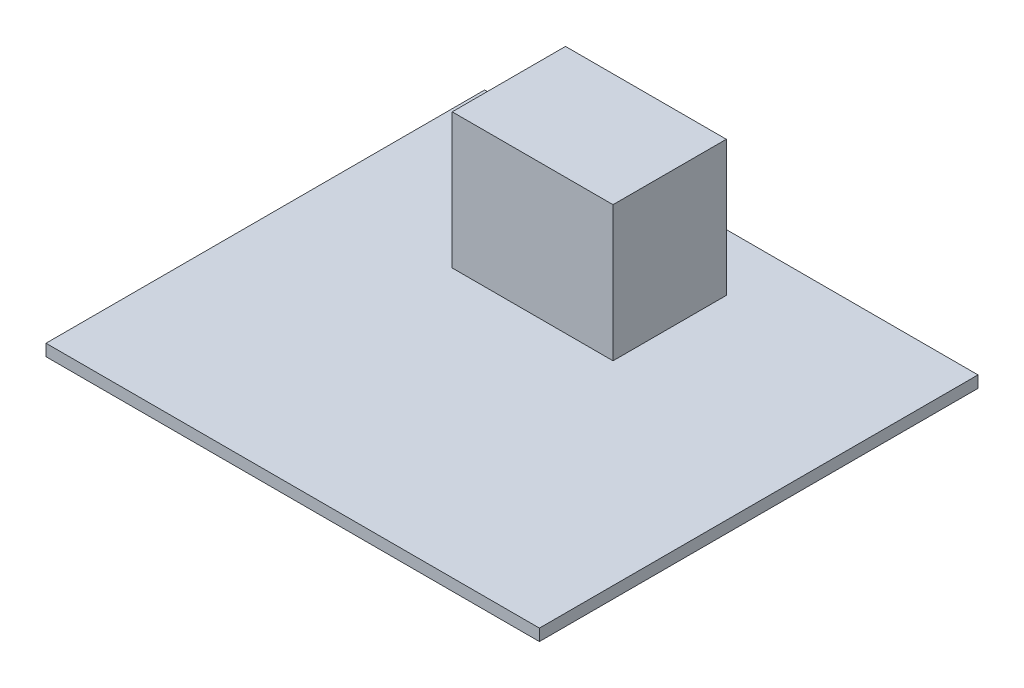
ISO-10303-21;
HEADER;
FILE_DESCRIPTION(('STEP AP214'),'2;1');
FILE_NAME('part.step','',(''),(''),'','','');
FILE_SCHEMA(('AUTOMOTIVE_DESIGN { 1 0 10303 214 1 1 1 1 }'));
ENDSEC;
DATA;
#1=APPLICATION_CONTEXT('core data for automotive mechanical design processes');
#2=APPLICATION_PROTOCOL_DEFINITION('international standard','automotive_design',2000,#1);
#3=PRODUCT_CONTEXT('',#1,'mechanical');
#4=PRODUCT('Part','Part','',(#3));
#5=PRODUCT_RELATED_PRODUCT_CATEGORY('part','',(#4));
#6=PRODUCT_DEFINITION_FORMATION('','',#4);
#7=PRODUCT_DEFINITION_CONTEXT('part definition',#1,'design');
#8=PRODUCT_DEFINITION('design','',#6,#7);
#9=PRODUCT_DEFINITION_SHAPE('','',#8);
#10=(LENGTH_UNIT() NAMED_UNIT(*) SI_UNIT(.MILLI.,.METRE.));
#11=(NAMED_UNIT(*) PLANE_ANGLE_UNIT() SI_UNIT($,.RADIAN.));
#12=(NAMED_UNIT(*) SI_UNIT($,.STERADIAN.) SOLID_ANGLE_UNIT());
#13=UNCERTAINTY_MEASURE_WITH_UNIT(LENGTH_MEASURE(1.E-05),#10,'distance_accuracy_value','');
#14=(GEOMETRIC_REPRESENTATION_CONTEXT(3) GLOBAL_UNCERTAINTY_ASSIGNED_CONTEXT((#13)) GLOBAL_UNIT_ASSIGNED_CONTEXT((#10,
#11,#12)) REPRESENTATION_CONTEXT('',''));
#15=CARTESIAN_POINT('',(0.,0.,0.));
#16=DIRECTION('',(0.,0.,1.));
#17=DIRECTION('',(1.,0.,0.));
#18=AXIS2_PLACEMENT_3D('',#15,#16,#17);
#19=CARTESIAN_POINT('',(0.,1.6,0.));
#20=DIRECTION('',(0.,1.,0.));
#21=DIRECTION('',(0.,0.,1.));
#22=AXIS2_PLACEMENT_3D('',#19,#20,#21);
#23=PLANE('',#22);
#24=DIRECTION('',(0.,0.,-1.));
#25=VECTOR('',#24,1.);
#26=CARTESIAN_POINT('',(33.75,1.6,-30.));
#27=LINE('',#26,#25);
#28=CARTESIAN_POINT('',(33.75,1.6,30.));
#29=VERTEX_POINT('',#28);
#30=CARTESIAN_POINT('',(33.75,1.6,-30.));
#31=VERTEX_POINT('',#30);
#32=EDGE_CURVE('E140',#29,#31,#27,.T.);
#33=ORIENTED_EDGE('',*,*,#32,.T.);
#34=DIRECTION('',(-1.,0.,0.));
#35=VECTOR('',#34,1.);
#36=CARTESIAN_POINT('',(-33.75,1.6,-30.));
#37=LINE('',#36,#35);
#38=CARTESIAN_POINT('',(-33.75,1.6,-30.));
#39=VERTEX_POINT('',#38);
#40=EDGE_CURVE('E85',#31,#39,#37,.T.);
#41=ORIENTED_EDGE('',*,*,#40,.T.);
#42=DIRECTION('',(0.,0.,1.));
#43=VECTOR('',#42,1.);
#44=CARTESIAN_POINT('',(-33.75,1.6,-30.));
#45=LINE('',#44,#43);
#46=CARTESIAN_POINT('',(-33.75,1.6,30.));
#47=VERTEX_POINT('',#46);
#48=EDGE_CURVE('E143',#39,#47,#45,.T.);
#49=ORIENTED_EDGE('',*,*,#48,.T.);
#50=DIRECTION('',(1.,0.,0.));
#51=VECTOR('',#50,1.);
#52=CARTESIAN_POINT('',(-33.75,1.6,30.));
#53=LINE('',#52,#51);
#54=EDGE_CURVE('E57',#47,#29,#53,.T.);
#55=ORIENTED_EDGE('',*,*,#54,.T.);
#56=EDGE_LOOP('',(#33,#41,#49,#55));
#57=FACE_BOUND('',#56,.T.);
#58=DIRECTION('',(-1.,0.,0.));
#59=VECTOR('',#58,1.);
#60=CARTESIAN_POINT('',(-14.88,1.6,-22.2));
#61=LINE('',#60,#59);
#62=CARTESIAN_POINT('',(7.12000000000001,1.6,-22.2));
#63=VERTEX_POINT('',#62);
#64=CARTESIAN_POINT('',(-14.88,1.6,-22.2));
#65=VERTEX_POINT('',#64);
#66=EDGE_CURVE('E263',#63,#65,#61,.T.);
#67=ORIENTED_EDGE('',*,*,#66,.F.);
#68=DIRECTION('',(0.,0.,-1.));
#69=VECTOR('',#68,1.);
#70=CARTESIAN_POINT('',(7.12000000000001,1.6,-22.2));
#71=LINE('',#70,#69);
#72=CARTESIAN_POINT('',(7.12000000000001,1.6,-6.69999999999999));
#73=VERTEX_POINT('',#72);
#74=EDGE_CURVE('E130',#73,#63,#71,.T.);
#75=ORIENTED_EDGE('',*,*,#74,.F.);
#76=DIRECTION('',(1.,0.,0.));
#77=VECTOR('',#76,1.);
#78=CARTESIAN_POINT('',(-14.88,1.6,-6.69999999999999));
#79=LINE('',#78,#77);
#80=CARTESIAN_POINT('',(-14.88,1.6,-6.69999999999999));
#81=VERTEX_POINT('',#80);
#82=EDGE_CURVE('E126',#81,#73,#79,.T.);
#83=ORIENTED_EDGE('',*,*,#82,.F.);
#84=DIRECTION('',(0.,0.,1.));
#85=VECTOR('',#84,1.);
#86=CARTESIAN_POINT('',(-14.88,1.6,-22.2));
#87=LINE('',#86,#85);
#88=EDGE_CURVE('E260',#65,#81,#87,.T.);
#89=ORIENTED_EDGE('',*,*,#88,.F.);
#90=EDGE_LOOP('',(#67,#75,#83,#89));
#91=FACE_BOUND('',#90,.T.);
#92=ADVANCED_FACE('F33',(#57,#91),#23,.T.);
#93=CARTESIAN_POINT('',(33.75,1.6,-30.));
#94=DIRECTION('',(-1.,0.,0.));
#95=DIRECTION('',(0.,0.,1.));
#96=AXIS2_PLACEMENT_3D('',#93,#94,#95);
#97=PLANE('',#96);
#98=DIRECTION('',(0.,0.,-1.));
#99=VECTOR('',#98,1.);
#100=CARTESIAN_POINT('',(33.75,0.,-30.));
#101=LINE('',#100,#99);
#102=CARTESIAN_POINT('',(33.75,0.,30.));
#103=VERTEX_POINT('',#102);
#104=CARTESIAN_POINT('',(33.75,0.,-30.));
#105=VERTEX_POINT('',#104);
#106=EDGE_CURVE('E132',#103,#105,#101,.T.);
#107=ORIENTED_EDGE('',*,*,#106,.T.);
#108=DIRECTION('',(0.,-1.,0.));
#109=VECTOR('',#108,1.);
#110=CARTESIAN_POINT('',(33.75,1.6,-30.));
#111=LINE('',#110,#109);
#112=EDGE_CURVE('E11',#31,#105,#111,.T.);
#113=ORIENTED_EDGE('',*,*,#112,.F.);
#114=ORIENTED_EDGE('',*,*,#32,.F.);
#115=DIRECTION('',(0.,-1.,0.));
#116=VECTOR('',#115,1.);
#117=CARTESIAN_POINT('',(33.75,1.6,30.));
#118=LINE('',#117,#116);
#119=EDGE_CURVE('E145',#29,#103,#118,.T.);
#120=ORIENTED_EDGE('',*,*,#119,.T.);
#121=EDGE_LOOP('',(#107,#113,#114,#120));
#122=FACE_BOUND('',#121,.T.);
#123=ADVANCED_FACE('F35',(#122),#97,.F.);
#124=CARTESIAN_POINT('',(-33.75,1.6,-30.));
#125=DIRECTION('',(0.,0.,1.));
#126=DIRECTION('',(1.,0.,0.));
#127=AXIS2_PLACEMENT_3D('',#124,#125,#126);
#128=PLANE('',#127);
#129=DIRECTION('',(-1.,0.,0.));
#130=VECTOR('',#129,1.);
#131=CARTESIAN_POINT('',(-33.75,0.,-30.));
#132=LINE('',#131,#130);
#133=CARTESIAN_POINT('',(-33.75,0.,-30.));
#134=VERTEX_POINT('',#133);
#135=EDGE_CURVE('E135',#105,#134,#132,.T.);
#136=ORIENTED_EDGE('',*,*,#135,.T.);
#137=DIRECTION('',(0.,-1.,0.));
#138=VECTOR('',#137,1.);
#139=CARTESIAN_POINT('',(-33.75,1.6,-30.));
#140=LINE('',#139,#138);
#141=EDGE_CURVE('E41',#39,#134,#140,.T.);
#142=ORIENTED_EDGE('',*,*,#141,.F.);
#143=ORIENTED_EDGE('',*,*,#40,.F.);
#144=ORIENTED_EDGE('',*,*,#112,.T.);
#145=EDGE_LOOP('',(#136,#142,#143,#144));
#146=FACE_BOUND('',#145,.T.);
#147=ADVANCED_FACE('F173',(#146),#128,.F.);
#148=CARTESIAN_POINT('',(-33.75,1.6,-30.));
#149=DIRECTION('',(1.,0.,0.));
#150=DIRECTION('',(0.,0.,-1.));
#151=AXIS2_PLACEMENT_3D('',#148,#149,#150);
#152=PLANE('',#151);
#153=DIRECTION('',(0.,0.,1.));
#154=VECTOR('',#153,1.);
#155=CARTESIAN_POINT('',(-33.75,0.,-30.));
#156=LINE('',#155,#154);
#157=CARTESIAN_POINT('',(-33.75,0.,30.));
#158=VERTEX_POINT('',#157);
#159=EDGE_CURVE('E148',#134,#158,#156,.T.);
#160=ORIENTED_EDGE('',*,*,#159,.T.);
#161=DIRECTION('',(0.,-1.,0.));
#162=VECTOR('',#161,1.);
#163=CARTESIAN_POINT('',(-33.75,1.6,30.));
#164=LINE('',#163,#162);
#165=EDGE_CURVE('E152',#47,#158,#164,.T.);
#166=ORIENTED_EDGE('',*,*,#165,.F.);
#167=ORIENTED_EDGE('',*,*,#48,.F.);
#168=ORIENTED_EDGE('',*,*,#141,.T.);
#169=EDGE_LOOP('',(#160,#166,#167,#168));
#170=FACE_BOUND('',#169,.T.);
#171=ADVANCED_FACE('F157',(#170),#152,.F.);
#172=CARTESIAN_POINT('',(-33.75,1.6,30.));
#173=DIRECTION('',(0.,0.,-1.));
#174=DIRECTION('',(-1.,0.,0.));
#175=AXIS2_PLACEMENT_3D('',#172,#173,#174);
#176=PLANE('',#175);
#177=DIRECTION('',(1.,0.,0.));
#178=VECTOR('',#177,1.);
#179=CARTESIAN_POINT('',(-33.75,0.,30.));
#180=LINE('',#179,#178);
#181=EDGE_CURVE('E78',#158,#103,#180,.T.);
#182=ORIENTED_EDGE('',*,*,#181,.T.);
#183=ORIENTED_EDGE('',*,*,#119,.F.);
#184=ORIENTED_EDGE('',*,*,#54,.F.);
#185=ORIENTED_EDGE('',*,*,#165,.T.);
#186=EDGE_LOOP('',(#182,#183,#184,#185));
#187=FACE_BOUND('',#186,.T.);
#188=ADVANCED_FACE('F165',(#187),#176,.F.);
#189=CARTESIAN_POINT('',(0.,0.,0.));
#190=DIRECTION('',(0.,1.,0.));
#191=DIRECTION('',(0.,0.,1.));
#192=AXIS2_PLACEMENT_3D('',#189,#190,#191);
#193=PLANE('',#192);
#194=ORIENTED_EDGE('',*,*,#106,.F.);
#195=ORIENTED_EDGE('',*,*,#181,.F.);
#196=ORIENTED_EDGE('',*,*,#159,.F.);
#197=ORIENTED_EDGE('',*,*,#135,.F.);
#198=EDGE_LOOP('',(#194,#195,#196,#197));
#199=FACE_BOUND('',#198,.T.);
#200=ADVANCED_FACE('F161',(#199),#193,.F.);
#201=CARTESIAN_POINT('',(7.12000000000001,20.1,-22.2));
#202=DIRECTION('',(-1.,0.,0.));
#203=DIRECTION('',(0.,0.,1.));
#204=AXIS2_PLACEMENT_3D('',#201,#202,#203);
#205=PLANE('',#204);
#206=ORIENTED_EDGE('',*,*,#74,.T.);
#207=DIRECTION('',(0.,-1.,0.));
#208=VECTOR('',#207,1.);
#209=CARTESIAN_POINT('',(7.12000000000001,20.1,-22.2));
#210=LINE('',#209,#208);
#211=CARTESIAN_POINT('',(7.12000000000001,20.1,-22.2));
#212=VERTEX_POINT('',#211);
#213=EDGE_CURVE('E111',#212,#63,#210,.T.);
#214=ORIENTED_EDGE('',*,*,#213,.F.);
#215=DIRECTION('',(0.,0.,-1.));
#216=VECTOR('',#215,1.);
#217=CARTESIAN_POINT('',(7.12000000000001,20.1,-22.2));
#218=LINE('',#217,#216);
#219=CARTESIAN_POINT('',(7.12000000000001,20.1,-6.69999999999999));
#220=VERTEX_POINT('',#219);
#221=EDGE_CURVE('E118',#220,#212,#218,.T.);
#222=ORIENTED_EDGE('',*,*,#221,.F.);
#223=DIRECTION('',(0.,-1.,0.));
#224=VECTOR('',#223,1.);
#225=CARTESIAN_POINT('',(7.12000000000001,20.1,-6.69999999999999));
#226=LINE('',#225,#224);
#227=EDGE_CURVE('E258',#220,#73,#226,.T.);
#228=ORIENTED_EDGE('',*,*,#227,.T.);
#229=EDGE_LOOP('',(#206,#214,#222,#228));
#230=FACE_BOUND('',#229,.T.);
#231=ADVANCED_FACE('F128',(#230),#205,.F.);
#232=CARTESIAN_POINT('',(-14.88,20.1,-22.2));
#233=DIRECTION('',(0.,0.,1.));
#234=DIRECTION('',(1.,0.,0.));
#235=AXIS2_PLACEMENT_3D('',#232,#233,#234);
#236=PLANE('',#235);
#237=ORIENTED_EDGE('',*,*,#66,.T.);
#238=DIRECTION('',(0.,-1.,0.));
#239=VECTOR('',#238,1.);
#240=CARTESIAN_POINT('',(-14.88,20.1,-22.2));
#241=LINE('',#240,#239);
#242=CARTESIAN_POINT('',(-14.88,20.1,-22.2));
#243=VERTEX_POINT('',#242);
#244=EDGE_CURVE('E114',#243,#65,#241,.T.);
#245=ORIENTED_EDGE('',*,*,#244,.F.);
#246=DIRECTION('',(-1.,0.,0.));
#247=VECTOR('',#246,1.);
#248=CARTESIAN_POINT('',(-14.88,20.1,-22.2));
#249=LINE('',#248,#247);
#250=EDGE_CURVE('E107',#212,#243,#249,.T.);
#251=ORIENTED_EDGE('',*,*,#250,.F.);
#252=ORIENTED_EDGE('',*,*,#213,.T.);
#253=EDGE_LOOP('',(#237,#245,#251,#252));
#254=FACE_BOUND('',#253,.T.);
#255=ADVANCED_FACE('F109',(#254),#236,.F.);
#256=CARTESIAN_POINT('',(-14.88,20.1,-22.2));
#257=DIRECTION('',(1.,0.,0.));
#258=DIRECTION('',(0.,0.,-1.));
#259=AXIS2_PLACEMENT_3D('',#256,#257,#258);
#260=PLANE('',#259);
#261=ORIENTED_EDGE('',*,*,#88,.T.);
#262=DIRECTION('',(0.,-1.,0.));
#263=VECTOR('',#262,1.);
#264=CARTESIAN_POINT('',(-14.88,20.1,-6.69999999999999));
#265=LINE('',#264,#263);
#266=CARTESIAN_POINT('',(-14.88,20.1,-6.69999999999999));
#267=VERTEX_POINT('',#266);
#268=EDGE_CURVE('E48',#267,#81,#265,.T.);
#269=ORIENTED_EDGE('',*,*,#268,.F.);
#270=DIRECTION('',(0.,0.,1.));
#271=VECTOR('',#270,1.);
#272=CARTESIAN_POINT('',(-14.88,20.1,-22.2));
#273=LINE('',#272,#271);
#274=EDGE_CURVE('E117',#243,#267,#273,.T.);
#275=ORIENTED_EDGE('',*,*,#274,.F.);
#276=ORIENTED_EDGE('',*,*,#244,.T.);
#277=EDGE_LOOP('',(#261,#269,#275,#276));
#278=FACE_BOUND('',#277,.T.);
#279=ADVANCED_FACE('F186',(#278),#260,.F.);
#280=CARTESIAN_POINT('',(-14.88,20.1,-6.69999999999999));
#281=DIRECTION('',(0.,0.,-1.));
#282=DIRECTION('',(-1.,0.,0.));
#283=AXIS2_PLACEMENT_3D('',#280,#281,#282);
#284=PLANE('',#283);
#285=ORIENTED_EDGE('',*,*,#82,.T.);
#286=ORIENTED_EDGE('',*,*,#227,.F.);
#287=DIRECTION('',(1.,0.,0.));
#288=VECTOR('',#287,1.);
#289=CARTESIAN_POINT('',(-14.88,20.1,-6.69999999999999));
#290=LINE('',#289,#288);
#291=EDGE_CURVE('E122',#267,#220,#290,.T.);
#292=ORIENTED_EDGE('',*,*,#291,.F.);
#293=ORIENTED_EDGE('',*,*,#268,.T.);
#294=EDGE_LOOP('',(#285,#286,#292,#293));
#295=FACE_BOUND('',#294,.T.);
#296=ADVANCED_FACE('F189',(#295),#284,.F.);
#297=CARTESIAN_POINT('',(0.,20.1,0.));
#298=DIRECTION('',(0.,1.,0.));
#299=DIRECTION('',(0.,0.,1.));
#300=AXIS2_PLACEMENT_3D('',#297,#298,#299);
#301=PLANE('',#300);
#302=ORIENTED_EDGE('',*,*,#221,.T.);
#303=ORIENTED_EDGE('',*,*,#250,.T.);
#304=ORIENTED_EDGE('',*,*,#274,.T.);
#305=ORIENTED_EDGE('',*,*,#291,.T.);
#306=EDGE_LOOP('',(#302,#303,#304,#305));
#307=FACE_BOUND('',#306,.T.);
#308=ADVANCED_FACE('F121',(#307),#301,.T.);
#309=CLOSED_SHELL('',(#92,#123,#147,#171,#188,#200,#231,#255,#279,#296,#308));
#310=MANIFOLD_SOLID_BREP('B2',#309);
#311=ADVANCED_BREP_SHAPE_REPRESENTATION('',(#18,#310),#14);
#312=SHAPE_DEFINITION_REPRESENTATION(#9,#311);
ENDSEC;
END-ISO-10303-21;
